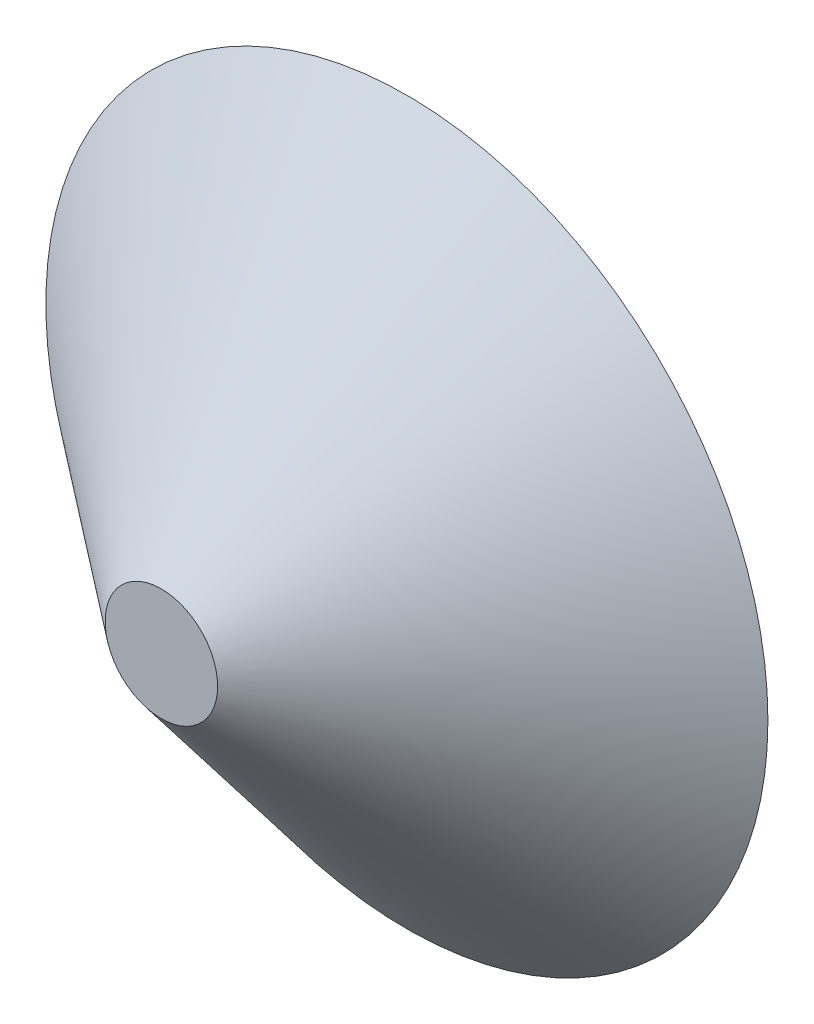
ISO-10303-21;
HEADER;
FILE_DESCRIPTION(('STEP AP214'),'2;1');
FILE_NAME('part.step','',(''),(''),'','','');
FILE_SCHEMA(('AUTOMOTIVE_DESIGN { 1 0 10303 214 1 1 1 1 }'));
ENDSEC;
DATA;
#1=APPLICATION_CONTEXT('core data for automotive mechanical design processes');
#2=APPLICATION_PROTOCOL_DEFINITION('international standard','automotive_design',2000,#1);
#3=PRODUCT_CONTEXT('',#1,'mechanical');
#4=PRODUCT('Part','Part','',(#3));
#5=PRODUCT_RELATED_PRODUCT_CATEGORY('part','',(#4));
#6=PRODUCT_DEFINITION_FORMATION('','',#4);
#7=PRODUCT_DEFINITION_CONTEXT('part definition',#1,'design');
#8=PRODUCT_DEFINITION('design','',#6,#7);
#9=PRODUCT_DEFINITION_SHAPE('','',#8);
#10=(LENGTH_UNIT() NAMED_UNIT(*) SI_UNIT(.MILLI.,.METRE.));
#11=(NAMED_UNIT(*) PLANE_ANGLE_UNIT() SI_UNIT($,.RADIAN.));
#12=(NAMED_UNIT(*) SI_UNIT($,.STERADIAN.) SOLID_ANGLE_UNIT());
#13=UNCERTAINTY_MEASURE_WITH_UNIT(LENGTH_MEASURE(1.E-05),#10,'distance_accuracy_value','');
#14=(GEOMETRIC_REPRESENTATION_CONTEXT(3) GLOBAL_UNCERTAINTY_ASSIGNED_CONTEXT((#13)) GLOBAL_UNIT_ASSIGNED_CONTEXT((#10,
#11,#12)) REPRESENTATION_CONTEXT('',''));
#15=CARTESIAN_POINT('',(0.,0.,0.));
#16=DIRECTION('',(0.,0.,1.));
#17=DIRECTION('',(1.,0.,0.));
#18=AXIS2_PLACEMENT_3D('',#15,#16,#17);
#19=CARTESIAN_POINT('',(0.,0.,0.));
#20=DIRECTION('',(0.,0.,-1.));
#21=DIRECTION('',(1.,0.,0.));
#22=AXIS2_PLACEMENT_3D('',#19,#20,#21);
#23=CONICAL_SURFACE('',#22,140.,0.892735912395102);
#24=CARTESIAN_POINT('',(0.,0.,95.2));
#25=DIRECTION('',(0.,0.,1.));
#26=DIRECTION('',(1.,0.,0.));
#27=AXIS2_PLACEMENT_3D('',#24,#25,#26);
#28=CIRCLE('',#27,21.8064419972155);
#29=CARTESIAN_POINT('',(21.8064419972155,0.,95.2));
#30=VERTEX_POINT('',#29);
#31=EDGE_CURVE('E10',#30,#30,#28,.T.);
#32=ORIENTED_EDGE('',*,*,#31,.F.);
#33=EDGE_LOOP('',(#32));
#34=FACE_BOUND('',#33,.T.);
#35=CARTESIAN_POINT('',(0.,0.,0.));
#36=DIRECTION('',(0.,0.,1.));
#37=DIRECTION('',(1.,0.,0.));
#38=AXIS2_PLACEMENT_3D('',#35,#36,#37);
#39=CIRCLE('',#38,140.);
#40=CARTESIAN_POINT('',(140.,0.,0.));
#41=VERTEX_POINT('',#40);
#42=EDGE_CURVE('E39',#41,#41,#39,.T.);
#43=ORIENTED_EDGE('',*,*,#42,.T.);
#44=EDGE_LOOP('',(#43));
#45=FACE_BOUND('',#44,.T.);
#46=ADVANCED_FACE('F33',(#34,#45),#23,.T.);
#47=CARTESIAN_POINT('',(0.,0.,95.2));
#48=DIRECTION('',(0.,0.,1.));
#49=DIRECTION('',(1.,0.,0.));
#50=AXIS2_PLACEMENT_3D('',#47,#48,#49);
#51=PLANE('',#50);
#52=ORIENTED_EDGE('',*,*,#31,.T.);
#53=EDGE_LOOP('',(#52));
#54=FACE_BOUND('',#53,.T.);
#55=ADVANCED_FACE('F67',(#54),#51,.T.);
#56=CARTESIAN_POINT('',(0.,0.,0.));
#57=DIRECTION('',(0.,0.,1.));
#58=DIRECTION('',(1.,0.,0.));
#59=AXIS2_PLACEMENT_3D('',#56,#57,#58);
#60=PLANE('',#59);
#61=CARTESIAN_POINT('',(0.,0.,0.));
#62=DIRECTION('',(0.,0.,1.));
#63=DIRECTION('',(1.,0.,0.));
#64=AXIS2_PLACEMENT_3D('',#61,#62,#63);
#65=CIRCLE('',#64,137.002950850078);
#66=CARTESIAN_POINT('',(137.002950850078,0.,0.));
#67=VERTEX_POINT('',#66);
#68=EDGE_CURVE('E47',#67,#67,#65,.T.);
#69=ORIENTED_EDGE('',*,*,#68,.T.);
#70=EDGE_LOOP('',(#69));
#71=FACE_BOUND('',#70,.T.);
#72=ORIENTED_EDGE('',*,*,#42,.F.);
#73=EDGE_LOOP('',(#72));
#74=FACE_BOUND('',#73,.T.);
#75=ADVANCED_FACE('F53',(#71,#74),#60,.F.);
#76=CARTESIAN_POINT('',(0.,0.,-1.46412680414817));
#77=DIRECTION('',(0.,0.,-1.));
#78=DIRECTION('',(1.,0.,0.));
#79=AXIS2_PLACEMENT_3D('',#76,#77,#78);
#80=CONICAL_SURFACE('',#79,138.820706694085,0.892735912395102);
#81=CARTESIAN_POINT('',(0.,0.,93.32));
#82=DIRECTION('',(0.,0.,1.));
#83=DIRECTION('',(1.,0.,0.));
#84=AXIS2_PLACEMENT_3D('',#81,#82,#83);
#85=CIRCLE('',#84,21.1434673120543);
#86=CARTESIAN_POINT('',(21.1434673120543,0.,93.32));
#87=VERTEX_POINT('',#86);
#88=EDGE_CURVE('E43',#87,#87,#85,.T.);
#89=ORIENTED_EDGE('',*,*,#88,.T.);
#90=EDGE_LOOP('',(#89));
#91=FACE_BOUND('',#90,.T.);
#92=ORIENTED_EDGE('',*,*,#68,.F.);
#93=EDGE_LOOP('',(#92));
#94=FACE_BOUND('',#93,.T.);
#95=ADVANCED_FACE('F56',(#91,#94),#80,.F.);
#96=CARTESIAN_POINT('',(0.,0.,93.32));
#97=DIRECTION('',(0.,0.,1.));
#98=DIRECTION('',(1.,0.,0.));
#99=AXIS2_PLACEMENT_3D('',#96,#97,#98);
#100=PLANE('',#99);
#101=ORIENTED_EDGE('',*,*,#88,.F.);
#102=EDGE_LOOP('',(#101));
#103=FACE_BOUND('',#102,.T.);
#104=ADVANCED_FACE('F58',(#103),#100,.F.);
#105=CLOSED_SHELL('',(#46,#55,#75,#95,#104));
#106=MANIFOLD_SOLID_BREP('B2',#105);
#107=ADVANCED_BREP_SHAPE_REPRESENTATION('',(#18,#106),#14);
#108=SHAPE_DEFINITION_REPRESENTATION(#9,#107);
ENDSEC;
END-ISO-10303-21;
